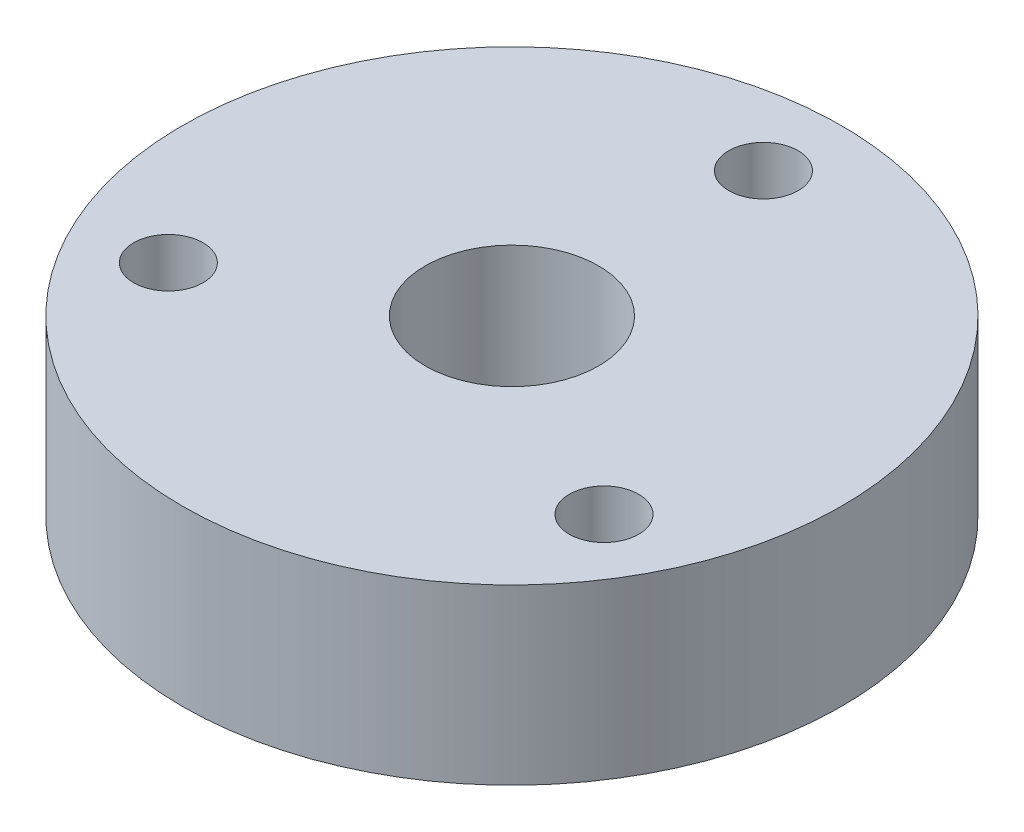
ISO-10303-21;
HEADER;
FILE_DESCRIPTION(('STEP AP214'),'2;1');
FILE_NAME('part.step','',(''),(''),'','','');
FILE_SCHEMA(('AUTOMOTIVE_DESIGN { 1 0 10303 214 1 1 1 1 }'));
ENDSEC;
DATA;
#1=APPLICATION_CONTEXT('core data for automotive mechanical design processes');
#2=APPLICATION_PROTOCOL_DEFINITION('international standard','automotive_design',2000,#1);
#3=PRODUCT_CONTEXT('',#1,'mechanical');
#4=PRODUCT('Part','Part','',(#3));
#5=PRODUCT_RELATED_PRODUCT_CATEGORY('part','',(#4));
#6=PRODUCT_DEFINITION_FORMATION('','',#4);
#7=PRODUCT_DEFINITION_CONTEXT('part definition',#1,'design');
#8=PRODUCT_DEFINITION('design','',#6,#7);
#9=PRODUCT_DEFINITION_SHAPE('','',#8);
#10=(LENGTH_UNIT() NAMED_UNIT(*) SI_UNIT(.MILLI.,.METRE.));
#11=(NAMED_UNIT(*) PLANE_ANGLE_UNIT() SI_UNIT($,.RADIAN.));
#12=(NAMED_UNIT(*) SI_UNIT($,.STERADIAN.) SOLID_ANGLE_UNIT());
#13=UNCERTAINTY_MEASURE_WITH_UNIT(LENGTH_MEASURE(1.E-05),#10,'distance_accuracy_value','');
#14=(GEOMETRIC_REPRESENTATION_CONTEXT(3) GLOBAL_UNCERTAINTY_ASSIGNED_CONTEXT((#13)) GLOBAL_UNIT_ASSIGNED_CONTEXT((#10,
#11,#12)) REPRESENTATION_CONTEXT('',''));
#15=CARTESIAN_POINT('',(0.,0.,0.));
#16=DIRECTION('',(0.,0.,1.));
#17=DIRECTION('',(1.,0.,0.));
#18=AXIS2_PLACEMENT_3D('',#15,#16,#17);
#19=CARTESIAN_POINT('',(0.,10.,0.));
#20=DIRECTION('',(0.,1.,0.));
#21=DIRECTION('',(0.,0.,1.));
#22=AXIS2_PLACEMENT_3D('',#19,#20,#21);
#23=PLANE('',#22);
#24=CARTESIAN_POINT('',(12.5573683548753,10.,7.24999999999946));
#25=DIRECTION('',(0.,1.,0.));
#26=DIRECTION('',(0.,0.,1.));
#27=AXIS2_PLACEMENT_3D('',#24,#25,#26);
#28=CIRCLE('',#27,2.00000000000081);
#29=CARTESIAN_POINT('',(12.5573683548753,10.,9.25000000000026));
#30=VERTEX_POINT('',#29);
#31=EDGE_CURVE('E54',#30,#30,#28,.T.);
#32=ORIENTED_EDGE('',*,*,#31,.F.);
#33=EDGE_LOOP('',(#32));
#34=FACE_BOUND('',#33,.T.);
#35=CARTESIAN_POINT('',(0.,10.,-14.5));
#36=DIRECTION('',(0.,1.,0.));
#37=DIRECTION('',(0.,0.,1.));
#38=AXIS2_PLACEMENT_3D('',#35,#36,#37);
#39=CIRCLE('',#38,2.);
#40=CARTESIAN_POINT('',(0.,10.,-12.5));
#41=VERTEX_POINT('',#40);
#42=EDGE_CURVE('E43',#41,#41,#39,.T.);
#43=ORIENTED_EDGE('',*,*,#42,.F.);
#44=EDGE_LOOP('',(#43));
#45=FACE_BOUND('',#44,.T.);
#46=CARTESIAN_POINT('',(0.,10.,0.));
#47=DIRECTION('',(0.,1.,0.));
#48=DIRECTION('',(0.,0.,1.));
#49=AXIS2_PLACEMENT_3D('',#46,#47,#48);
#50=CIRCLE('',#49,19.);
#51=CARTESIAN_POINT('',(0.,10.,19.));
#52=VERTEX_POINT('',#51);
#53=EDGE_CURVE('E10',#52,#52,#50,.T.);
#54=ORIENTED_EDGE('',*,*,#53,.T.);
#55=EDGE_LOOP('',(#54));
#56=FACE_BOUND('',#55,.T.);
#57=CARTESIAN_POINT('',(0.,10.,0.));
#58=DIRECTION('',(0.,1.,0.));
#59=DIRECTION('',(0.,0.,1.));
#60=AXIS2_PLACEMENT_3D('',#57,#58,#59);
#61=CIRCLE('',#60,5.);
#62=CARTESIAN_POINT('',(0.,10.,5.));
#63=VERTEX_POINT('',#62);
#64=EDGE_CURVE('E48',#63,#63,#61,.T.);
#65=ORIENTED_EDGE('',*,*,#64,.F.);
#66=EDGE_LOOP('',(#65));
#67=FACE_BOUND('',#66,.T.);
#68=CARTESIAN_POINT('',(-12.5573683548734,10.,7.25000000000054));
#69=DIRECTION('',(0.,1.,0.));
#70=DIRECTION('',(0.,0.,1.));
#71=AXIS2_PLACEMENT_3D('',#68,#69,#70);
#72=CIRCLE('',#71,2.00000000000117);
#73=CARTESIAN_POINT('',(-12.5573683548734,10.,9.25000000000172));
#74=VERTEX_POINT('',#73);
#75=EDGE_CURVE('E60',#74,#74,#72,.T.);
#76=ORIENTED_EDGE('',*,*,#75,.F.);
#77=EDGE_LOOP('',(#76));
#78=FACE_BOUND('',#77,.T.);
#79=ADVANCED_FACE('F32',(#34,#45,#56,#67,#78),#23,.T.);
#80=CARTESIAN_POINT('',(0.,0.,0.));
#81=DIRECTION('',(0.,1.,0.));
#82=DIRECTION('',(0.,0.,1.));
#83=AXIS2_PLACEMENT_3D('',#80,#81,#82);
#84=PLANE('',#83);
#85=CARTESIAN_POINT('',(0.,0.,0.));
#86=DIRECTION('',(0.,1.,0.));
#87=DIRECTION('',(0.,0.,1.));
#88=AXIS2_PLACEMENT_3D('',#85,#86,#87);
#89=CIRCLE('',#88,19.);
#90=CARTESIAN_POINT('',(0.,0.,19.));
#91=VERTEX_POINT('',#90);
#92=EDGE_CURVE('E36',#91,#91,#89,.T.);
#93=ORIENTED_EDGE('',*,*,#92,.F.);
#94=EDGE_LOOP('',(#93));
#95=FACE_BOUND('',#94,.T.);
#96=CARTESIAN_POINT('',(0.,0.,-14.5));
#97=DIRECTION('',(0.,1.,0.));
#98=DIRECTION('',(0.,0.,1.));
#99=AXIS2_PLACEMENT_3D('',#96,#97,#98);
#100=CIRCLE('',#99,2.);
#101=CARTESIAN_POINT('',(0.,0.,-12.5));
#102=VERTEX_POINT('',#101);
#103=EDGE_CURVE('E45',#102,#102,#100,.T.);
#104=ORIENTED_EDGE('',*,*,#103,.T.);
#105=EDGE_LOOP('',(#104));
#106=FACE_BOUND('',#105,.T.);
#107=CARTESIAN_POINT('',(0.,0.,0.));
#108=DIRECTION('',(0.,1.,0.));
#109=DIRECTION('',(0.,0.,1.));
#110=AXIS2_PLACEMENT_3D('',#107,#108,#109);
#111=CIRCLE('',#110,5.);
#112=CARTESIAN_POINT('',(0.,0.,5.));
#113=VERTEX_POINT('',#112);
#114=EDGE_CURVE('E51',#113,#113,#111,.T.);
#115=ORIENTED_EDGE('',*,*,#114,.T.);
#116=EDGE_LOOP('',(#115));
#117=FACE_BOUND('',#116,.T.);
#118=CARTESIAN_POINT('',(12.5573683548753,0.,7.24999999999946));
#119=DIRECTION('',(0.,1.,0.));
#120=DIRECTION('',(0.,0.,1.));
#121=AXIS2_PLACEMENT_3D('',#118,#119,#120);
#122=CIRCLE('',#121,2.00000000000081);
#123=CARTESIAN_POINT('',(12.5573683548753,0.,9.25000000000026));
#124=VERTEX_POINT('',#123);
#125=EDGE_CURVE('E57',#124,#124,#122,.T.);
#126=ORIENTED_EDGE('',*,*,#125,.T.);
#127=EDGE_LOOP('',(#126));
#128=FACE_BOUND('',#127,.T.);
#129=CARTESIAN_POINT('',(-12.5573683548734,0.,7.25000000000054));
#130=DIRECTION('',(0.,1.,0.));
#131=DIRECTION('',(0.,0.,1.));
#132=AXIS2_PLACEMENT_3D('',#129,#130,#131);
#133=CIRCLE('',#132,2.00000000000117);
#134=CARTESIAN_POINT('',(-12.5573683548734,0.,9.25000000000172));
#135=VERTEX_POINT('',#134);
#136=EDGE_CURVE('E63',#135,#135,#133,.T.);
#137=ORIENTED_EDGE('',*,*,#136,.T.);
#138=EDGE_LOOP('',(#137));
#139=FACE_BOUND('',#138,.T.);
#140=ADVANCED_FACE('F73',(#95,#106,#117,#128,#139),#84,.F.);
#141=CARTESIAN_POINT('',(0.,10.,0.));
#142=DIRECTION('',(0.,-1.,0.));
#143=DIRECTION('',(0.,0.,-1.));
#144=AXIS2_PLACEMENT_3D('',#141,#142,#143);
#145=CYLINDRICAL_SURFACE('',#144,19.);
#146=ORIENTED_EDGE('',*,*,#53,.F.);
#147=EDGE_LOOP('',(#146));
#148=FACE_BOUND('',#147,.T.);
#149=ORIENTED_EDGE('',*,*,#92,.T.);
#150=EDGE_LOOP('',(#149));
#151=FACE_BOUND('',#150,.T.);
#152=ADVANCED_FACE('F34',(#148,#151),#145,.T.);
#153=CARTESIAN_POINT('',(0.,10.,-14.5));
#154=DIRECTION('',(0.,-1.,0.));
#155=DIRECTION('',(0.,0.,-1.));
#156=AXIS2_PLACEMENT_3D('',#153,#154,#155);
#157=CYLINDRICAL_SURFACE('',#156,2.);
#158=ORIENTED_EDGE('',*,*,#42,.T.);
#159=EDGE_LOOP('',(#158));
#160=FACE_BOUND('',#159,.T.);
#161=ORIENTED_EDGE('',*,*,#103,.F.);
#162=EDGE_LOOP('',(#161));
#163=FACE_BOUND('',#162,.T.);
#164=ADVANCED_FACE('F83',(#160,#163),#157,.F.);
#165=CARTESIAN_POINT('',(0.,10.,0.));
#166=DIRECTION('',(0.,-1.,0.));
#167=DIRECTION('',(0.,0.,-1.));
#168=AXIS2_PLACEMENT_3D('',#165,#166,#167);
#169=CYLINDRICAL_SURFACE('',#168,5.);
#170=ORIENTED_EDGE('',*,*,#64,.T.);
#171=EDGE_LOOP('',(#170));
#172=FACE_BOUND('',#171,.T.);
#173=ORIENTED_EDGE('',*,*,#114,.F.);
#174=EDGE_LOOP('',(#173));
#175=FACE_BOUND('',#174,.T.);
#176=ADVANCED_FACE('F86',(#172,#175),#169,.F.);
#177=CARTESIAN_POINT('',(12.5573683548753,10.,7.24999999999946));
#178=DIRECTION('',(0.,-1.,0.));
#179=DIRECTION('',(0.,0.,-1.));
#180=AXIS2_PLACEMENT_3D('',#177,#178,#179);
#181=CYLINDRICAL_SURFACE('',#180,2.00000000000081);
#182=ORIENTED_EDGE('',*,*,#31,.T.);
#183=EDGE_LOOP('',(#182));
#184=FACE_BOUND('',#183,.T.);
#185=ORIENTED_EDGE('',*,*,#125,.F.);
#186=EDGE_LOOP('',(#185));
#187=FACE_BOUND('',#186,.T.);
#188=ADVANCED_FACE('F90',(#184,#187),#181,.F.);
#189=CARTESIAN_POINT('',(-12.5573683548734,10.,7.25000000000054));
#190=DIRECTION('',(0.,-1.,0.));
#191=DIRECTION('',(0.,0.,-1.));
#192=AXIS2_PLACEMENT_3D('',#189,#190,#191);
#193=CYLINDRICAL_SURFACE('',#192,2.00000000000117);
#194=ORIENTED_EDGE('',*,*,#75,.T.);
#195=EDGE_LOOP('',(#194));
#196=FACE_BOUND('',#195,.T.);
#197=ORIENTED_EDGE('',*,*,#136,.F.);
#198=EDGE_LOOP('',(#197));
#199=FACE_BOUND('',#198,.T.);
#200=ADVANCED_FACE('F69',(#196,#199),#193,.F.);
#201=CLOSED_SHELL('',(#79,#140,#152,#164,#176,#188,#200));
#202=MANIFOLD_SOLID_BREP('B2',#201);
#203=ADVANCED_BREP_SHAPE_REPRESENTATION('',(#18,#202),#14);
#204=SHAPE_DEFINITION_REPRESENTATION(#9,#203);
ENDSEC;
END-ISO-10303-21;
